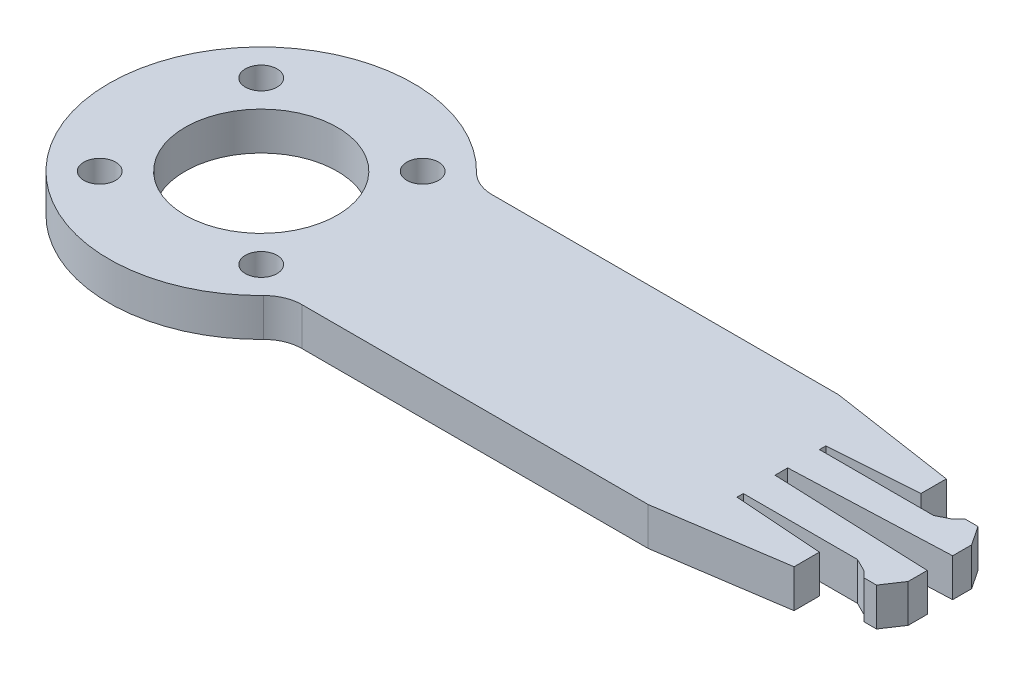
ISO-10303-21;
HEADER;
FILE_DESCRIPTION(('STEP AP214'),'2;1');
FILE_NAME('part.step','',(''),(''),'','','');
FILE_SCHEMA(('AUTOMOTIVE_DESIGN { 1 0 10303 214 1 1 1 1 }'));
ENDSEC;
DATA;
#1=APPLICATION_CONTEXT('core data for automotive mechanical design processes');
#2=APPLICATION_PROTOCOL_DEFINITION('international standard','automotive_design',2000,#1);
#3=PRODUCT_CONTEXT('',#1,'mechanical');
#4=PRODUCT('Part','Part','',(#3));
#5=PRODUCT_RELATED_PRODUCT_CATEGORY('part','',(#4));
#6=PRODUCT_DEFINITION_FORMATION('','',#4);
#7=PRODUCT_DEFINITION_CONTEXT('part definition',#1,'design');
#8=PRODUCT_DEFINITION('design','',#6,#7);
#9=PRODUCT_DEFINITION_SHAPE('','',#8);
#10=(LENGTH_UNIT() NAMED_UNIT(*) SI_UNIT(.MILLI.,.METRE.));
#11=(NAMED_UNIT(*) PLANE_ANGLE_UNIT() SI_UNIT($,.RADIAN.));
#12=(NAMED_UNIT(*) SI_UNIT($,.STERADIAN.) SOLID_ANGLE_UNIT());
#13=UNCERTAINTY_MEASURE_WITH_UNIT(LENGTH_MEASURE(1.E-05),#10,'distance_accuracy_value','');
#14=(GEOMETRIC_REPRESENTATION_CONTEXT(3) GLOBAL_UNCERTAINTY_ASSIGNED_CONTEXT((#13)) GLOBAL_UNIT_ASSIGNED_CONTEXT((#10,
#11,#12)) REPRESENTATION_CONTEXT('',''));
#15=CARTESIAN_POINT('',(0.,0.,0.));
#16=DIRECTION('',(0.,0.,1.));
#17=DIRECTION('',(1.,0.,0.));
#18=AXIS2_PLACEMENT_3D('',#15,#16,#17);
#19=CARTESIAN_POINT('',(1.93643031784841,1.5,12.9095354523227));
#20=DIRECTION('',(0.148340452930245,0.,0.988936352868298));
#21=DIRECTION('',(0.988936352868298,0.,-0.148340452930245));
#22=AXIS2_PLACEMENT_3D('',#19,#20,#21);
#23=PLANE('',#22);
#24=DIRECTION('',(-0.988936352868298,0.,0.148340452930245));
#25=VECTOR('',#24,1.);
#26=CARTESIAN_POINT('',(1.93643031784841,-1.5,12.9095354523227));
#27=LINE('',#26,#25);
#28=CARTESIAN_POINT('',(48.,-1.5,6.));
#29=VERTEX_POINT('',#28);
#30=CARTESIAN_POINT('',(38.,-1.5,7.5));
#31=VERTEX_POINT('',#30);
#32=EDGE_CURVE('E224',#29,#31,#27,.T.);
#33=ORIENTED_EDGE('',*,*,#32,.F.);
#34=DIRECTION('',(0.,-1.,0.));
#35=VECTOR('',#34,1.);
#36=CARTESIAN_POINT('',(48.,1.5,6.));
#37=LINE('',#36,#35);
#38=CARTESIAN_POINT('',(48.,1.5,6.));
#39=VERTEX_POINT('',#38);
#40=EDGE_CURVE('E219',#39,#29,#37,.T.);
#41=ORIENTED_EDGE('',*,*,#40,.F.);
#42=DIRECTION('',(-0.988936352868298,0.,0.148340452930245));
#43=VECTOR('',#42,1.);
#44=CARTESIAN_POINT('',(1.93643031784841,1.5,12.9095354523227));
#45=LINE('',#44,#43);
#46=CARTESIAN_POINT('',(38.,1.5,7.5));
#47=VERTEX_POINT('',#46);
#48=EDGE_CURVE('E222',#39,#47,#45,.T.);
#49=ORIENTED_EDGE('',*,*,#48,.T.);
#50=DIRECTION('',(0.,-1.,0.));
#51=VECTOR('',#50,1.);
#52=CARTESIAN_POINT('',(38.,1.5,7.5));
#53=LINE('',#52,#51);
#54=EDGE_CURVE('E320',#47,#31,#53,.T.);
#55=ORIENTED_EDGE('',*,*,#54,.T.);
#56=EDGE_LOOP('',(#33,#41,#49,#55));
#57=FACE_BOUND('',#56,.T.);
#58=ADVANCED_FACE('F36',(#57),#23,.T.);
#59=CARTESIAN_POINT('',(48.,1.5,0.));
#60=DIRECTION('',(1.,0.,0.));
#61=DIRECTION('',(0.,0.,-1.));
#62=AXIS2_PLACEMENT_3D('',#59,#60,#61);
#63=PLANE('',#62);
#64=DIRECTION('',(0.,0.,1.));
#65=VECTOR('',#64,1.);
#66=CARTESIAN_POINT('',(48.,-1.5,0.));
#67=LINE('',#66,#65);
#68=CARTESIAN_POINT('',(48.,-1.5,4.));
#69=VERTEX_POINT('',#68);
#70=EDGE_CURVE('E322',#69,#29,#67,.T.);
#71=ORIENTED_EDGE('',*,*,#70,.F.);
#72=DIRECTION('',(0.,-1.,0.));
#73=VECTOR('',#72,1.);
#74=CARTESIAN_POINT('',(48.,1.5,4.));
#75=LINE('',#74,#73);
#76=CARTESIAN_POINT('',(48.,1.5,4.));
#77=VERTEX_POINT('',#76);
#78=EDGE_CURVE('E230',#77,#69,#75,.T.);
#79=ORIENTED_EDGE('',*,*,#78,.F.);
#80=DIRECTION('',(0.,0.,1.));
#81=VECTOR('',#80,1.);
#82=CARTESIAN_POINT('',(48.,1.5,0.));
#83=LINE('',#82,#81);
#84=EDGE_CURVE('E237',#77,#39,#83,.T.);
#85=ORIENTED_EDGE('',*,*,#84,.T.);
#86=ORIENTED_EDGE('',*,*,#40,.T.);
#87=EDGE_LOOP('',(#71,#79,#85,#86));
#88=FACE_BOUND('',#87,.T.);
#89=ADVANCED_FACE('F244',(#88),#63,.T.);
#90=CARTESIAN_POINT('',(-0.0406091370558376,1.5,0.568527918781726));
#91=DIRECTION('',(0.0712470499879096,0.,-0.997458699830735));
#92=DIRECTION('',(-0.997458699830735,0.,-0.0712470499879096));
#93=AXIS2_PLACEMENT_3D('',#90,#91,#92);
#94=PLANE('',#93);
#95=DIRECTION('',(0.997458699830735,0.,0.0712470499879096));
#96=VECTOR('',#95,1.);
#97=CARTESIAN_POINT('',(-0.0406091370558376,-1.5,0.568527918781726));
#98=LINE('',#97,#96);
#99=CARTESIAN_POINT('',(41.,-1.5,3.5));
#100=VERTEX_POINT('',#99);
#101=EDGE_CURVE('E324',#100,#69,#98,.T.);
#102=ORIENTED_EDGE('',*,*,#101,.F.);
#103=DIRECTION('',(0.,-1.,0.));
#104=VECTOR('',#103,1.);
#105=CARTESIAN_POINT('',(41.,1.5,3.5));
#106=LINE('',#105,#104);
#107=CARTESIAN_POINT('',(41.,1.5,3.5));
#108=VERTEX_POINT('',#107);
#109=EDGE_CURVE('E450',#108,#100,#106,.T.);
#110=ORIENTED_EDGE('',*,*,#109,.F.);
#111=DIRECTION('',(0.997458699830735,0.,0.0712470499879096));
#112=VECTOR('',#111,1.);
#113=CARTESIAN_POINT('',(-0.0406091370558376,1.5,0.568527918781726));
#114=LINE('',#113,#112);
#115=EDGE_CURVE('E245',#108,#77,#114,.T.);
#116=ORIENTED_EDGE('',*,*,#115,.T.);
#117=ORIENTED_EDGE('',*,*,#78,.T.);
#118=EDGE_LOOP('',(#102,#110,#116,#117));
#119=FACE_BOUND('',#118,.T.);
#120=ADVANCED_FACE('F573',(#119),#94,.T.);
#121=CARTESIAN_POINT('',(41.,1.5,-5.68989300120392E-13));
#122=DIRECTION('',(1.,0.,0.));
#123=DIRECTION('',(0.,0.,-1.));
#124=AXIS2_PLACEMENT_3D('',#121,#122,#123);
#125=PLANE('',#124);
#126=DIRECTION('',(0.,0.,1.));
#127=VECTOR('',#126,1.);
#128=CARTESIAN_POINT('',(41.,-1.5,-5.68989300120392E-13));
#129=LINE('',#128,#127);
#130=CARTESIAN_POINT('',(41.,-1.5,3.));
#131=VERTEX_POINT('',#130);
#132=EDGE_CURVE('E327',#131,#100,#129,.T.);
#133=ORIENTED_EDGE('',*,*,#132,.F.);
#134=DIRECTION('',(0.,-1.,0.));
#135=VECTOR('',#134,1.);
#136=CARTESIAN_POINT('',(41.,1.5,3.));
#137=LINE('',#136,#135);
#138=CARTESIAN_POINT('',(41.,1.5,3.));
#139=VERTEX_POINT('',#138);
#140=EDGE_CURVE('E448',#139,#131,#137,.T.);
#141=ORIENTED_EDGE('',*,*,#140,.F.);
#142=DIRECTION('',(0.,0.,1.));
#143=VECTOR('',#142,1.);
#144=CARTESIAN_POINT('',(41.,1.5,-5.68989300120392E-13));
#145=LINE('',#144,#143);
#146=EDGE_CURVE('E247',#139,#108,#145,.T.);
#147=ORIENTED_EDGE('',*,*,#146,.T.);
#148=ORIENTED_EDGE('',*,*,#109,.T.);
#149=EDGE_LOOP('',(#133,#141,#147,#148));
#150=FACE_BOUND('',#149,.T.);
#151=ADVANCED_FACE('F570',(#150),#125,.T.);
#152=CARTESIAN_POINT('',(0.,1.5,2.99999999999999));
#153=DIRECTION('',(0.,0.,1.));
#154=DIRECTION('',(1.,0.,0.));
#155=AXIS2_PLACEMENT_3D('',#152,#153,#154);
#156=PLANE('',#155);
#157=DIRECTION('',(-1.,0.,0.));
#158=VECTOR('',#157,1.);
#159=CARTESIAN_POINT('',(0.,-1.5,2.99999999999999));
#160=LINE('',#159,#158);
#161=CARTESIAN_POINT('',(50.,-1.5,3.));
#162=VERTEX_POINT('',#161);
#163=EDGE_CURVE('E330',#162,#131,#160,.T.);
#164=ORIENTED_EDGE('',*,*,#163,.F.);
#165=DIRECTION('',(0.,-1.,0.));
#166=VECTOR('',#165,1.);
#167=CARTESIAN_POINT('',(50.,1.5,3.));
#168=LINE('',#167,#166);
#169=CARTESIAN_POINT('',(50.,1.5,3.));
#170=VERTEX_POINT('',#169);
#171=EDGE_CURVE('E446',#170,#162,#168,.T.);
#172=ORIENTED_EDGE('',*,*,#171,.F.);
#173=DIRECTION('',(-1.,0.,0.));
#174=VECTOR('',#173,1.);
#175=CARTESIAN_POINT('',(0.,1.5,2.99999999999999));
#176=LINE('',#175,#174);
#177=EDGE_CURVE('E252',#170,#139,#176,.T.);
#178=ORIENTED_EDGE('',*,*,#177,.T.);
#179=ORIENTED_EDGE('',*,*,#140,.T.);
#180=EDGE_LOOP('',(#164,#172,#178,#179));
#181=FACE_BOUND('',#180,.T.);
#182=ADVANCED_FACE('F566',(#181),#156,.T.);
#183=CARTESIAN_POINT('',(8.79999999999998,1.5,-17.6));
#184=DIRECTION('',(-0.447213595499958,0.,0.894427190999916));
#185=DIRECTION('',(0.894427190999916,0.,0.447213595499958));
#186=AXIS2_PLACEMENT_3D('',#183,#184,#185);
#187=PLANE('',#186);
#188=DIRECTION('',(-0.894427190999916,0.,-0.447213595499958));
#189=VECTOR('',#188,1.);
#190=CARTESIAN_POINT('',(8.79999999999998,-1.5,-17.6));
#191=LINE('',#190,#189);
#192=CARTESIAN_POINT('',(51.,-1.5,3.5));
#193=VERTEX_POINT('',#192);
#194=EDGE_CURVE('E333',#193,#162,#191,.T.);
#195=ORIENTED_EDGE('',*,*,#194,.F.);
#196=DIRECTION('',(0.,-1.,0.));
#197=VECTOR('',#196,1.);
#198=CARTESIAN_POINT('',(51.,1.5,3.5));
#199=LINE('',#198,#197);
#200=CARTESIAN_POINT('',(51.,1.5,3.5));
#201=VERTEX_POINT('',#200);
#202=EDGE_CURVE('E444',#201,#193,#199,.T.);
#203=ORIENTED_EDGE('',*,*,#202,.F.);
#204=DIRECTION('',(-0.894427190999916,0.,-0.447213595499958));
#205=VECTOR('',#204,1.);
#206=CARTESIAN_POINT('',(8.79999999999998,1.5,-17.6));
#207=LINE('',#206,#205);
#208=EDGE_CURVE('E255',#201,#170,#207,.T.);
#209=ORIENTED_EDGE('',*,*,#208,.T.);
#210=ORIENTED_EDGE('',*,*,#171,.T.);
#211=EDGE_LOOP('',(#195,#203,#209,#210));
#212=FACE_BOUND('',#211,.T.);
#213=ADVANCED_FACE('F562',(#212),#187,.T.);
#214=CARTESIAN_POINT('',(23.75,1.5,-23.75));
#215=DIRECTION('',(-0.707106781186547,0.,0.707106781186548));
#216=DIRECTION('',(0.707106781186548,0.,0.707106781186547));
#217=AXIS2_PLACEMENT_3D('',#214,#215,#216);
#218=PLANE('',#217);
#219=DIRECTION('',(-0.707106781186548,0.,-0.707106781186547));
#220=VECTOR('',#219,1.);
#221=CARTESIAN_POINT('',(23.75,-1.5,-23.75));
#222=LINE('',#221,#220);
#223=CARTESIAN_POINT('',(51.5,-1.5,4.));
#224=VERTEX_POINT('',#223);
#225=EDGE_CURVE('E336',#224,#193,#222,.T.);
#226=ORIENTED_EDGE('',*,*,#225,.F.);
#227=DIRECTION('',(0.,-1.,0.));
#228=VECTOR('',#227,1.);
#229=CARTESIAN_POINT('',(51.5,1.5,4.));
#230=LINE('',#229,#228);
#231=CARTESIAN_POINT('',(51.5,1.5,4.));
#232=VERTEX_POINT('',#231);
#233=EDGE_CURVE('E442',#232,#224,#230,.T.);
#234=ORIENTED_EDGE('',*,*,#233,.F.);
#235=DIRECTION('',(-0.707106781186548,0.,-0.707106781186547));
#236=VECTOR('',#235,1.);
#237=CARTESIAN_POINT('',(23.75,1.5,-23.75));
#238=LINE('',#237,#236);
#239=EDGE_CURVE('E258',#232,#201,#238,.T.);
#240=ORIENTED_EDGE('',*,*,#239,.T.);
#241=ORIENTED_EDGE('',*,*,#202,.T.);
#242=EDGE_LOOP('',(#226,#234,#240,#241));
#243=FACE_BOUND('',#242,.T.);
#244=ADVANCED_FACE('F558',(#243),#218,.T.);
#245=CARTESIAN_POINT('',(0.,1.5,3.99999999999996));
#246=DIRECTION('',(0.,0.,1.));
#247=DIRECTION('',(1.,0.,0.));
#248=AXIS2_PLACEMENT_3D('',#245,#246,#247);
#249=PLANE('',#248);
#250=DIRECTION('',(-1.,0.,0.));
#251=VECTOR('',#250,1.);
#252=CARTESIAN_POINT('',(0.,-1.5,3.99999999999996));
#253=LINE('',#252,#251);
#254=CARTESIAN_POINT('',(52.5,-1.5,4.));
#255=VERTEX_POINT('',#254);
#256=EDGE_CURVE('E339',#255,#224,#253,.T.);
#257=ORIENTED_EDGE('',*,*,#256,.F.);
#258=DIRECTION('',(0.,-1.,0.));
#259=VECTOR('',#258,1.);
#260=CARTESIAN_POINT('',(52.5,1.5,4.));
#261=LINE('',#260,#259);
#262=CARTESIAN_POINT('',(52.5,1.5,4.));
#263=VERTEX_POINT('',#262);
#264=EDGE_CURVE('E440',#263,#255,#261,.T.);
#265=ORIENTED_EDGE('',*,*,#264,.F.);
#266=DIRECTION('',(-1.,0.,0.));
#267=VECTOR('',#266,1.);
#268=CARTESIAN_POINT('',(0.,1.5,3.99999999999996));
#269=LINE('',#268,#267);
#270=EDGE_CURVE('E261',#263,#232,#269,.T.);
#271=ORIENTED_EDGE('',*,*,#270,.T.);
#272=ORIENTED_EDGE('',*,*,#233,.T.);
#273=EDGE_LOOP('',(#257,#265,#271,#272));
#274=FACE_BOUND('',#273,.T.);
#275=ADVANCED_FACE('F554',(#274),#249,.T.);
#276=CARTESIAN_POINT('',(38.1923076923077,1.5,25.4615384615385));
#277=DIRECTION('',(0.832050294337844,0.,0.554700196225229));
#278=DIRECTION('',(0.554700196225229,0.,-0.832050294337843));
#279=AXIS2_PLACEMENT_3D('',#276,#277,#278);
#280=PLANE('',#279);
#281=DIRECTION('',(-0.554700196225229,0.,0.832050294337844));
#282=VECTOR('',#281,1.);
#283=CARTESIAN_POINT('',(38.1923076923077,-1.5,25.4615384615385));
#284=LINE('',#283,#282);
#285=CARTESIAN_POINT('',(53.5,-1.5,2.5));
#286=VERTEX_POINT('',#285);
#287=EDGE_CURVE('E342',#286,#255,#284,.T.);
#288=ORIENTED_EDGE('',*,*,#287,.F.);
#289=DIRECTION('',(0.,-1.,0.));
#290=VECTOR('',#289,1.);
#291=CARTESIAN_POINT('',(53.5,1.5,2.5));
#292=LINE('',#291,#290);
#293=CARTESIAN_POINT('',(53.5,1.5,2.5));
#294=VERTEX_POINT('',#293);
#295=EDGE_CURVE('E438',#294,#286,#292,.T.);
#296=ORIENTED_EDGE('',*,*,#295,.F.);
#297=DIRECTION('',(-0.554700196225229,0.,0.832050294337844));
#298=VECTOR('',#297,1.);
#299=CARTESIAN_POINT('',(38.1923076923077,1.5,25.4615384615385));
#300=LINE('',#299,#298);
#301=EDGE_CURVE('E264',#294,#263,#300,.T.);
#302=ORIENTED_EDGE('',*,*,#301,.T.);
#303=ORIENTED_EDGE('',*,*,#264,.T.);
#304=EDGE_LOOP('',(#288,#296,#302,#303));
#305=FACE_BOUND('',#304,.T.);
#306=ADVANCED_FACE('F550',(#305),#280,.T.);
#307=CARTESIAN_POINT('',(53.5,1.5,0.));
#308=DIRECTION('',(1.,0.,0.));
#309=DIRECTION('',(0.,0.,-1.));
#310=AXIS2_PLACEMENT_3D('',#307,#308,#309);
#311=PLANE('',#310);
#312=DIRECTION('',(0.,0.,1.));
#313=VECTOR('',#312,1.);
#314=CARTESIAN_POINT('',(53.5,-1.5,0.));
#315=LINE('',#314,#313);
#316=CARTESIAN_POINT('',(53.5,-1.5,1.));
#317=VERTEX_POINT('',#316);
#318=EDGE_CURVE('E345',#317,#286,#315,.T.);
#319=ORIENTED_EDGE('',*,*,#318,.F.);
#320=DIRECTION('',(0.,-1.,0.));
#321=VECTOR('',#320,1.);
#322=CARTESIAN_POINT('',(53.5,1.5,1.));
#323=LINE('',#322,#321);
#324=CARTESIAN_POINT('',(53.5,1.5,1.));
#325=VERTEX_POINT('',#324);
#326=EDGE_CURVE('E436',#325,#317,#323,.T.);
#327=ORIENTED_EDGE('',*,*,#326,.F.);
#328=DIRECTION('',(0.,0.,1.));
#329=VECTOR('',#328,1.);
#330=CARTESIAN_POINT('',(53.5,1.5,0.));
#331=LINE('',#330,#329);
#332=EDGE_CURVE('E267',#325,#294,#331,.T.);
#333=ORIENTED_EDGE('',*,*,#332,.T.);
#334=ORIENTED_EDGE('',*,*,#295,.T.);
#335=EDGE_LOOP('',(#319,#327,#333,#334));
#336=FACE_BOUND('',#335,.T.);
#337=ADVANCED_FACE('F546',(#336),#311,.T.);
#338=CARTESIAN_POINT('',(0.0455271565495208,1.5,-1.13817891373802));
#339=DIRECTION('',(0.0399680383488716,0.,-0.999200958721789));
#340=DIRECTION('',(-0.99920095872179,0.,-0.0399680383488716));
#341=AXIS2_PLACEMENT_3D('',#338,#339,#340);
#342=PLANE('',#341);
#343=DIRECTION('',(0.99920095872179,0.,0.0399680383488716));
#344=VECTOR('',#343,1.);
#345=CARTESIAN_POINT('',(0.0455271565495208,-1.5,-1.13817891373802));
#346=LINE('',#345,#344);
#347=CARTESIAN_POINT('',(41.,-1.5,0.5));
#348=VERTEX_POINT('',#347);
#349=EDGE_CURVE('E348',#348,#317,#346,.T.);
#350=ORIENTED_EDGE('',*,*,#349,.F.);
#351=DIRECTION('',(0.,-1.,0.));
#352=VECTOR('',#351,1.);
#353=CARTESIAN_POINT('',(41.,1.5,0.5));
#354=LINE('',#353,#352);
#355=CARTESIAN_POINT('',(41.,1.5,0.5));
#356=VERTEX_POINT('',#355);
#357=EDGE_CURVE('E434',#356,#348,#354,.T.);
#358=ORIENTED_EDGE('',*,*,#357,.F.);
#359=DIRECTION('',(0.99920095872179,0.,0.0399680383488716));
#360=VECTOR('',#359,1.);
#361=CARTESIAN_POINT('',(0.0455271565495208,1.5,-1.13817891373802));
#362=LINE('',#361,#360);
#363=EDGE_CURVE('E270',#356,#325,#362,.T.);
#364=ORIENTED_EDGE('',*,*,#363,.T.);
#365=ORIENTED_EDGE('',*,*,#326,.T.);
#366=EDGE_LOOP('',(#350,#358,#364,#365));
#367=FACE_BOUND('',#366,.T.);
#368=ADVANCED_FACE('F542',(#367),#342,.T.);
#369=CARTESIAN_POINT('',(41.,1.5,0.));
#370=DIRECTION('',(1.,0.,0.));
#371=DIRECTION('',(0.,0.,-1.));
#372=AXIS2_PLACEMENT_3D('',#369,#370,#371);
#373=PLANE('',#372);
#374=DIRECTION('',(0.,0.,1.));
#375=VECTOR('',#374,1.);
#376=CARTESIAN_POINT('',(41.,-1.5,0.));
#377=LINE('',#376,#375);
#378=CARTESIAN_POINT('',(41.,-1.5,-0.5));
#379=VERTEX_POINT('',#378);
#380=EDGE_CURVE('E351',#379,#348,#377,.T.);
#381=ORIENTED_EDGE('',*,*,#380,.F.);
#382=DIRECTION('',(0.,-1.,0.));
#383=VECTOR('',#382,1.);
#384=CARTESIAN_POINT('',(41.,1.5,-0.5));
#385=LINE('',#384,#383);
#386=CARTESIAN_POINT('',(41.,1.5,-0.5));
#387=VERTEX_POINT('',#386);
#388=EDGE_CURVE('E432',#387,#379,#385,.T.);
#389=ORIENTED_EDGE('',*,*,#388,.F.);
#390=DIRECTION('',(0.,0.,1.));
#391=VECTOR('',#390,1.);
#392=CARTESIAN_POINT('',(41.,1.5,0.));
#393=LINE('',#392,#391);
#394=EDGE_CURVE('E273',#387,#356,#393,.T.);
#395=ORIENTED_EDGE('',*,*,#394,.T.);
#396=ORIENTED_EDGE('',*,*,#357,.T.);
#397=EDGE_LOOP('',(#381,#389,#395,#396));
#398=FACE_BOUND('',#397,.T.);
#399=ADVANCED_FACE('F536',(#398),#373,.T.);
#400=CARTESIAN_POINT('',(0.0455271565495208,1.5,1.13817891373802));
#401=DIRECTION('',(-0.0399680383488716,0.,-0.999200958721789));
#402=DIRECTION('',(-0.99920095872179,0.,0.0399680383488716));
#403=AXIS2_PLACEMENT_3D('',#400,#401,#402);
#404=PLANE('',#403);
#405=DIRECTION('',(0.99920095872179,0.,-0.0399680383488716));
#406=VECTOR('',#405,1.);
#407=CARTESIAN_POINT('',(0.0455271565495208,-1.5,1.13817891373802));
#408=LINE('',#407,#406);
#409=CARTESIAN_POINT('',(53.5,-1.5,-1.));
#410=VERTEX_POINT('',#409);
#411=EDGE_CURVE('E354',#379,#410,#408,.T.);
#412=ORIENTED_EDGE('',*,*,#411,.T.);
#413=DIRECTION('',(0.,-1.,0.));
#414=VECTOR('',#413,1.);
#415=CARTESIAN_POINT('',(53.5,1.5,-1.));
#416=LINE('',#415,#414);
#417=CARTESIAN_POINT('',(53.5,1.5,-1.));
#418=VERTEX_POINT('',#417);
#419=EDGE_CURVE('E429',#418,#410,#416,.T.);
#420=ORIENTED_EDGE('',*,*,#419,.F.);
#421=DIRECTION('',(0.99920095872179,0.,-0.0399680383488716));
#422=VECTOR('',#421,1.);
#423=CARTESIAN_POINT('',(0.0455271565495208,1.5,1.13817891373802));
#424=LINE('',#423,#422);
#425=EDGE_CURVE('E276',#387,#418,#424,.T.);
#426=ORIENTED_EDGE('',*,*,#425,.F.);
#427=ORIENTED_EDGE('',*,*,#388,.T.);
#428=EDGE_LOOP('',(#412,#420,#426,#427));
#429=FACE_BOUND('',#428,.T.);
#430=ADVANCED_FACE('F574',(#429),#404,.F.);
#431=CARTESIAN_POINT('',(53.5,1.5,0.));
#432=DIRECTION('',(-1.,0.,0.));
#433=DIRECTION('',(0.,0.,1.));
#434=AXIS2_PLACEMENT_3D('',#431,#432,#433);
#435=PLANE('',#434);
#436=DIRECTION('',(0.,0.,-1.));
#437=VECTOR('',#436,1.);
#438=CARTESIAN_POINT('',(53.5,-1.5,0.));
#439=LINE('',#438,#437);
#440=CARTESIAN_POINT('',(53.5,-1.5,-2.5));
#441=VERTEX_POINT('',#440);
#442=EDGE_CURVE('E356',#410,#441,#439,.T.);
#443=ORIENTED_EDGE('',*,*,#442,.T.);
#444=DIRECTION('',(0.,-1.,0.));
#445=VECTOR('',#444,1.);
#446=CARTESIAN_POINT('',(53.5,1.5,-2.5));
#447=LINE('',#446,#445);
#448=CARTESIAN_POINT('',(53.5,1.5,-2.5));
#449=VERTEX_POINT('',#448);
#450=EDGE_CURVE('E426',#449,#441,#447,.T.);
#451=ORIENTED_EDGE('',*,*,#450,.F.);
#452=DIRECTION('',(0.,0.,-1.));
#453=VECTOR('',#452,1.);
#454=CARTESIAN_POINT('',(53.5,1.5,0.));
#455=LINE('',#454,#453);
#456=EDGE_CURVE('E278',#418,#449,#455,.T.);
#457=ORIENTED_EDGE('',*,*,#456,.F.);
#458=ORIENTED_EDGE('',*,*,#419,.T.);
#459=EDGE_LOOP('',(#443,#451,#457,#458));
#460=FACE_BOUND('',#459,.T.);
#461=ADVANCED_FACE('F530',(#460),#435,.F.);
#462=CARTESIAN_POINT('',(38.1923076923077,1.5,-25.4615384615385));
#463=DIRECTION('',(-0.832050294337844,0.,0.554700196225229));
#464=DIRECTION('',(0.554700196225229,0.,0.832050294337843));
#465=AXIS2_PLACEMENT_3D('',#462,#463,#464);
#466=PLANE('',#465);
#467=DIRECTION('',(-0.554700196225229,0.,-0.832050294337844));
#468=VECTOR('',#467,1.);
#469=CARTESIAN_POINT('',(38.1923076923077,-1.5,-25.4615384615385));
#470=LINE('',#469,#468);
#471=CARTESIAN_POINT('',(52.5,-1.5,-4.));
#472=VERTEX_POINT('',#471);
#473=EDGE_CURVE('E358',#441,#472,#470,.T.);
#474=ORIENTED_EDGE('',*,*,#473,.T.);
#475=DIRECTION('',(0.,-1.,0.));
#476=VECTOR('',#475,1.);
#477=CARTESIAN_POINT('',(52.5,1.5,-4.));
#478=LINE('',#477,#476);
#479=CARTESIAN_POINT('',(52.5,1.5,-4.));
#480=VERTEX_POINT('',#479);
#481=EDGE_CURVE('E423',#480,#472,#478,.T.);
#482=ORIENTED_EDGE('',*,*,#481,.F.);
#483=DIRECTION('',(-0.554700196225229,0.,-0.832050294337844));
#484=VECTOR('',#483,1.);
#485=CARTESIAN_POINT('',(38.1923076923077,1.5,-25.4615384615385));
#486=LINE('',#485,#484);
#487=EDGE_CURVE('E280',#449,#480,#486,.T.);
#488=ORIENTED_EDGE('',*,*,#487,.F.);
#489=ORIENTED_EDGE('',*,*,#450,.T.);
#490=EDGE_LOOP('',(#474,#482,#488,#489));
#491=FACE_BOUND('',#490,.T.);
#492=ADVANCED_FACE('F526',(#491),#466,.F.);
#493=CARTESIAN_POINT('',(0.,1.5,-3.99999999999996));
#494=DIRECTION('',(0.,0.,1.));
#495=DIRECTION('',(1.,0.,0.));
#496=AXIS2_PLACEMENT_3D('',#493,#494,#495);
#497=PLANE('',#496);
#498=DIRECTION('',(-1.,0.,0.));
#499=VECTOR('',#498,1.);
#500=CARTESIAN_POINT('',(0.,-1.5,-3.99999999999996));
#501=LINE('',#500,#499);
#502=CARTESIAN_POINT('',(51.5,-1.5,-4.));
#503=VERTEX_POINT('',#502);
#504=EDGE_CURVE('E360',#472,#503,#501,.T.);
#505=ORIENTED_EDGE('',*,*,#504,.T.);
#506=DIRECTION('',(0.,-1.,0.));
#507=VECTOR('',#506,1.);
#508=CARTESIAN_POINT('',(51.5,1.5,-4.));
#509=LINE('',#508,#507);
#510=CARTESIAN_POINT('',(51.5,1.5,-4.));
#511=VERTEX_POINT('',#510);
#512=EDGE_CURVE('E420',#511,#503,#509,.T.);
#513=ORIENTED_EDGE('',*,*,#512,.F.);
#514=DIRECTION('',(-1.,0.,0.));
#515=VECTOR('',#514,1.);
#516=CARTESIAN_POINT('',(0.,1.5,-3.99999999999996));
#517=LINE('',#516,#515);
#518=EDGE_CURVE('E282',#480,#511,#517,.T.);
#519=ORIENTED_EDGE('',*,*,#518,.F.);
#520=ORIENTED_EDGE('',*,*,#481,.T.);
#521=EDGE_LOOP('',(#505,#513,#519,#520));
#522=FACE_BOUND('',#521,.T.);
#523=ADVANCED_FACE('F521',(#522),#497,.F.);
#524=CARTESIAN_POINT('',(23.75,1.5,23.75));
#525=DIRECTION('',(0.707106781186547,0.,0.707106781186548));
#526=DIRECTION('',(0.707106781186548,0.,-0.707106781186547));
#527=AXIS2_PLACEMENT_3D('',#524,#525,#526);
#528=PLANE('',#527);
#529=DIRECTION('',(-0.707106781186548,0.,0.707106781186547));
#530=VECTOR('',#529,1.);
#531=CARTESIAN_POINT('',(23.75,-1.5,23.75));
#532=LINE('',#531,#530);
#533=CARTESIAN_POINT('',(51.,-1.5,-3.5));
#534=VERTEX_POINT('',#533);
#535=EDGE_CURVE('E362',#503,#534,#532,.T.);
#536=ORIENTED_EDGE('',*,*,#535,.T.);
#537=DIRECTION('',(0.,-1.,0.));
#538=VECTOR('',#537,1.);
#539=CARTESIAN_POINT('',(51.,1.5,-3.5));
#540=LINE('',#539,#538);
#541=CARTESIAN_POINT('',(51.,1.5,-3.5));
#542=VERTEX_POINT('',#541);
#543=EDGE_CURVE('E417',#542,#534,#540,.T.);
#544=ORIENTED_EDGE('',*,*,#543,.F.);
#545=DIRECTION('',(-0.707106781186548,0.,0.707106781186547));
#546=VECTOR('',#545,1.);
#547=CARTESIAN_POINT('',(23.75,1.5,23.75));
#548=LINE('',#547,#546);
#549=EDGE_CURVE('E284',#511,#542,#548,.T.);
#550=ORIENTED_EDGE('',*,*,#549,.F.);
#551=ORIENTED_EDGE('',*,*,#512,.T.);
#552=EDGE_LOOP('',(#536,#544,#550,#551));
#553=FACE_BOUND('',#552,.T.);
#554=ADVANCED_FACE('F515',(#553),#528,.F.);
#555=CARTESIAN_POINT('',(8.79999999999998,1.5,17.6));
#556=DIRECTION('',(0.447213595499958,0.,0.894427190999916));
#557=DIRECTION('',(0.894427190999916,0.,-0.447213595499958));
#558=AXIS2_PLACEMENT_3D('',#555,#556,#557);
#559=PLANE('',#558);
#560=DIRECTION('',(-0.894427190999916,0.,0.447213595499958));
#561=VECTOR('',#560,1.);
#562=CARTESIAN_POINT('',(8.79999999999998,-1.5,17.6));
#563=LINE('',#562,#561);
#564=CARTESIAN_POINT('',(50.,-1.5,-3.));
#565=VERTEX_POINT('',#564);
#566=EDGE_CURVE('E364',#534,#565,#563,.T.);
#567=ORIENTED_EDGE('',*,*,#566,.T.);
#568=DIRECTION('',(0.,-1.,0.));
#569=VECTOR('',#568,1.);
#570=CARTESIAN_POINT('',(50.,1.5,-3.));
#571=LINE('',#570,#569);
#572=CARTESIAN_POINT('',(50.,1.5,-3.));
#573=VERTEX_POINT('',#572);
#574=EDGE_CURVE('E414',#573,#565,#571,.T.);
#575=ORIENTED_EDGE('',*,*,#574,.F.);
#576=DIRECTION('',(-0.894427190999916,0.,0.447213595499958));
#577=VECTOR('',#576,1.);
#578=CARTESIAN_POINT('',(8.79999999999998,1.5,17.6));
#579=LINE('',#578,#577);
#580=EDGE_CURVE('E286',#542,#573,#579,.T.);
#581=ORIENTED_EDGE('',*,*,#580,.F.);
#582=ORIENTED_EDGE('',*,*,#543,.T.);
#583=EDGE_LOOP('',(#567,#575,#581,#582));
#584=FACE_BOUND('',#583,.T.);
#585=ADVANCED_FACE('F511',(#584),#559,.F.);
#586=CARTESIAN_POINT('',(0.,1.5,-2.99999999999999));
#587=DIRECTION('',(0.,0.,1.));
#588=DIRECTION('',(1.,0.,0.));
#589=AXIS2_PLACEMENT_3D('',#586,#587,#588);
#590=PLANE('',#589);
#591=DIRECTION('',(-1.,0.,0.));
#592=VECTOR('',#591,1.);
#593=CARTESIAN_POINT('',(0.,-1.5,-2.99999999999999));
#594=LINE('',#593,#592);
#595=CARTESIAN_POINT('',(41.,-1.5,-3.));
#596=VERTEX_POINT('',#595);
#597=EDGE_CURVE('E366',#565,#596,#594,.T.);
#598=ORIENTED_EDGE('',*,*,#597,.T.);
#599=DIRECTION('',(0.,-1.,0.));
#600=VECTOR('',#599,1.);
#601=CARTESIAN_POINT('',(41.,1.5,-3.));
#602=LINE('',#601,#600);
#603=CARTESIAN_POINT('',(41.,1.5,-3.));
#604=VERTEX_POINT('',#603);
#605=EDGE_CURVE('E411',#604,#596,#602,.T.);
#606=ORIENTED_EDGE('',*,*,#605,.F.);
#607=DIRECTION('',(-1.,0.,0.));
#608=VECTOR('',#607,1.);
#609=CARTESIAN_POINT('',(0.,1.5,-2.99999999999999));
#610=LINE('',#609,#608);
#611=EDGE_CURVE('E288',#573,#604,#610,.T.);
#612=ORIENTED_EDGE('',*,*,#611,.F.);
#613=ORIENTED_EDGE('',*,*,#574,.T.);
#614=EDGE_LOOP('',(#598,#606,#612,#613));
#615=FACE_BOUND('',#614,.T.);
#616=ADVANCED_FACE('F506',(#615),#590,.F.);
#617=CARTESIAN_POINT('',(41.,1.5,5.68989300120392E-13));
#618=DIRECTION('',(-1.,0.,0.));
#619=DIRECTION('',(0.,0.,1.));
#620=AXIS2_PLACEMENT_3D('',#617,#618,#619);
#621=PLANE('',#620);
#622=DIRECTION('',(0.,0.,-1.));
#623=VECTOR('',#622,1.);
#624=CARTESIAN_POINT('',(41.,-1.5,5.68989300120392E-13));
#625=LINE('',#624,#623);
#626=CARTESIAN_POINT('',(41.,-1.5,-3.5));
#627=VERTEX_POINT('',#626);
#628=EDGE_CURVE('E368',#596,#627,#625,.T.);
#629=ORIENTED_EDGE('',*,*,#628,.T.);
#630=DIRECTION('',(0.,-1.,0.));
#631=VECTOR('',#630,1.);
#632=CARTESIAN_POINT('',(41.,1.5,-3.5));
#633=LINE('',#632,#631);
#634=CARTESIAN_POINT('',(41.,1.5,-3.5));
#635=VERTEX_POINT('',#634);
#636=EDGE_CURVE('E408',#635,#627,#633,.T.);
#637=ORIENTED_EDGE('',*,*,#636,.F.);
#638=DIRECTION('',(0.,0.,-1.));
#639=VECTOR('',#638,1.);
#640=CARTESIAN_POINT('',(41.,1.5,5.68989300120392E-13));
#641=LINE('',#640,#639);
#642=EDGE_CURVE('E290',#604,#635,#641,.T.);
#643=ORIENTED_EDGE('',*,*,#642,.F.);
#644=ORIENTED_EDGE('',*,*,#605,.T.);
#645=EDGE_LOOP('',(#629,#637,#643,#644));
#646=FACE_BOUND('',#645,.T.);
#647=ADVANCED_FACE('F500',(#646),#621,.F.);
#648=CARTESIAN_POINT('',(-0.0406091370558376,1.5,-0.568527918781726));
#649=DIRECTION('',(-0.0712470499879096,0.,-0.997458699830735));
#650=DIRECTION('',(-0.997458699830735,0.,0.0712470499879096));
#651=AXIS2_PLACEMENT_3D('',#648,#649,#650);
#652=PLANE('',#651);
#653=DIRECTION('',(0.997458699830735,0.,-0.0712470499879096));
#654=VECTOR('',#653,1.);
#655=CARTESIAN_POINT('',(-0.0406091370558376,-1.5,-0.568527918781726));
#656=LINE('',#655,#654);
#657=CARTESIAN_POINT('',(48.,-1.5,-4.));
#658=VERTEX_POINT('',#657);
#659=EDGE_CURVE('E370',#627,#658,#656,.T.);
#660=ORIENTED_EDGE('',*,*,#659,.T.);
#661=DIRECTION('',(0.,-1.,0.));
#662=VECTOR('',#661,1.);
#663=CARTESIAN_POINT('',(48.,1.5,-4.));
#664=LINE('',#663,#662);
#665=CARTESIAN_POINT('',(48.,1.5,-4.));
#666=VERTEX_POINT('',#665);
#667=EDGE_CURVE('E405',#666,#658,#664,.T.);
#668=ORIENTED_EDGE('',*,*,#667,.F.);
#669=DIRECTION('',(0.997458699830735,0.,-0.0712470499879096));
#670=VECTOR('',#669,1.);
#671=CARTESIAN_POINT('',(-0.0406091370558376,1.5,-0.568527918781726));
#672=LINE('',#671,#670);
#673=EDGE_CURVE('E292',#635,#666,#672,.T.);
#674=ORIENTED_EDGE('',*,*,#673,.F.);
#675=ORIENTED_EDGE('',*,*,#636,.T.);
#676=EDGE_LOOP('',(#660,#668,#674,#675));
#677=FACE_BOUND('',#676,.T.);
#678=ADVANCED_FACE('F496',(#677),#652,.F.);
#679=CARTESIAN_POINT('',(48.,1.5,0.));
#680=DIRECTION('',(-1.,0.,0.));
#681=DIRECTION('',(0.,0.,1.));
#682=AXIS2_PLACEMENT_3D('',#679,#680,#681);
#683=PLANE('',#682);
#684=DIRECTION('',(0.,0.,-1.));
#685=VECTOR('',#684,1.);
#686=CARTESIAN_POINT('',(48.,-1.5,0.));
#687=LINE('',#686,#685);
#688=CARTESIAN_POINT('',(48.,-1.5,-6.));
#689=VERTEX_POINT('',#688);
#690=EDGE_CURVE('E372',#658,#689,#687,.T.);
#691=ORIENTED_EDGE('',*,*,#690,.T.);
#692=DIRECTION('',(0.,-1.,0.));
#693=VECTOR('',#692,1.);
#694=CARTESIAN_POINT('',(48.,1.5,-6.));
#695=LINE('',#694,#693);
#696=CARTESIAN_POINT('',(48.,1.5,-6.));
#697=VERTEX_POINT('',#696);
#698=EDGE_CURVE('E402',#697,#689,#695,.T.);
#699=ORIENTED_EDGE('',*,*,#698,.F.);
#700=DIRECTION('',(0.,0.,-1.));
#701=VECTOR('',#700,1.);
#702=CARTESIAN_POINT('',(48.,1.5,0.));
#703=LINE('',#702,#701);
#704=EDGE_CURVE('E294',#666,#697,#703,.T.);
#705=ORIENTED_EDGE('',*,*,#704,.F.);
#706=ORIENTED_EDGE('',*,*,#667,.T.);
#707=EDGE_LOOP('',(#691,#699,#705,#706));
#708=FACE_BOUND('',#707,.T.);
#709=ADVANCED_FACE('F491',(#708),#683,.F.);
#710=CARTESIAN_POINT('',(1.93643031784841,1.5,-12.9095354523227));
#711=DIRECTION('',(-0.148340452930245,0.,0.988936352868298));
#712=DIRECTION('',(0.988936352868298,0.,0.148340452930245));
#713=AXIS2_PLACEMENT_3D('',#710,#711,#712);
#714=PLANE('',#713);
#715=DIRECTION('',(-0.988936352868298,0.,-0.148340452930245));
#716=VECTOR('',#715,1.);
#717=CARTESIAN_POINT('',(1.93643031784841,-1.5,-12.9095354523227));
#718=LINE('',#717,#716);
#719=CARTESIAN_POINT('',(38.,-1.5,-7.5));
#720=VERTEX_POINT('',#719);
#721=EDGE_CURVE('E374',#689,#720,#718,.T.);
#722=ORIENTED_EDGE('',*,*,#721,.T.);
#723=DIRECTION('',(0.,-1.,0.));
#724=VECTOR('',#723,1.);
#725=CARTESIAN_POINT('',(38.,1.5,-7.5));
#726=LINE('',#725,#724);
#727=CARTESIAN_POINT('',(38.,1.5,-7.5));
#728=VERTEX_POINT('',#727);
#729=EDGE_CURVE('E399',#728,#720,#726,.T.);
#730=ORIENTED_EDGE('',*,*,#729,.F.);
#731=DIRECTION('',(-0.988936352868298,0.,-0.148340452930245));
#732=VECTOR('',#731,1.);
#733=CARTESIAN_POINT('',(1.93643031784841,1.5,-12.9095354523227));
#734=LINE('',#733,#732);
#735=EDGE_CURVE('E296',#697,#728,#734,.T.);
#736=ORIENTED_EDGE('',*,*,#735,.F.);
#737=ORIENTED_EDGE('',*,*,#698,.T.);
#738=EDGE_LOOP('',(#722,#730,#736,#737));
#739=FACE_BOUND('',#738,.T.);
#740=ADVANCED_FACE('F485',(#739),#714,.F.);
#741=CARTESIAN_POINT('',(0.,1.5,-7.5));
#742=DIRECTION('',(0.,0.,-1.));
#743=DIRECTION('',(-1.,0.,0.));
#744=AXIS2_PLACEMENT_3D('',#741,#742,#743);
#745=PLANE('',#744);
#746=DIRECTION('',(1.,0.,0.));
#747=VECTOR('',#746,1.);
#748=CARTESIAN_POINT('',(0.,-1.5,-7.5));
#749=LINE('',#748,#747);
#750=CARTESIAN_POINT('',(10.7121426428143,-1.5,-7.5));
#751=VERTEX_POINT('',#750);
#752=EDGE_CURVE('E377',#751,#720,#749,.T.);
#753=ORIENTED_EDGE('',*,*,#752,.F.);
#754=DIRECTION('',(0.,-1.,0.));
#755=VECTOR('',#754,1.);
#756=CARTESIAN_POINT('',(10.7121426428143,1.5,-7.5));
#757=LINE('',#756,#755);
#758=CARTESIAN_POINT('',(10.7121426428143,1.5,-7.5));
#759=VERTEX_POINT('',#758);
#760=EDGE_CURVE('E51',#751,#759,#757,.F.);
#761=ORIENTED_EDGE('',*,*,#760,.T.);
#762=DIRECTION('',(1.,0.,0.));
#763=VECTOR('',#762,1.);
#764=CARTESIAN_POINT('',(0.,1.5,-7.5));
#765=LINE('',#764,#763);
#766=EDGE_CURVE('E299',#759,#728,#765,.T.);
#767=ORIENTED_EDGE('',*,*,#766,.T.);
#768=ORIENTED_EDGE('',*,*,#729,.T.);
#769=EDGE_LOOP('',(#753,#761,#767,#768));
#770=FACE_BOUND('',#769,.T.);
#771=ADVANCED_FACE('F482',(#770),#745,.T.);
#772=CARTESIAN_POINT('',(0.,1.5,0.));
#773=DIRECTION('',(0.,-1.,0.));
#774=DIRECTION('',(0.,0.,-1.));
#775=AXIS2_PLACEMENT_3D('',#772,#773,#774);
#776=CYLINDRICAL_SURFACE('',#775,12.);
#777=CARTESIAN_POINT('',(0.,-1.5,0.));
#778=DIRECTION('',(0.,1.,0.));
#779=DIRECTION('',(0.,0.,1.));
#780=AXIS2_PLACEMENT_3D('',#777,#778,#779);
#781=CIRCLE('',#780,12.);
#782=CARTESIAN_POINT('',(8.56971411425142,-1.5,-8.4));
#783=VERTEX_POINT('',#782);
#784=CARTESIAN_POINT('',(8.56971411425142,-1.5,8.4));
#785=VERTEX_POINT('',#784);
#786=EDGE_CURVE('E379',#783,#785,#781,.T.);
#787=ORIENTED_EDGE('',*,*,#786,.T.);
#788=DIRECTION('',(0.,-1.,0.));
#789=VECTOR('',#788,1.);
#790=CARTESIAN_POINT('',(8.56971411425142,1.5,8.4));
#791=LINE('',#790,#789);
#792=CARTESIAN_POINT('',(8.56971411425142,1.5,8.4));
#793=VERTEX_POINT('',#792);
#794=EDGE_CURVE('E458',#785,#793,#791,.F.);
#795=ORIENTED_EDGE('',*,*,#794,.T.);
#796=CARTESIAN_POINT('',(0.,1.5,0.));
#797=DIRECTION('',(0.,1.,0.));
#798=DIRECTION('',(0.,0.,1.));
#799=AXIS2_PLACEMENT_3D('',#796,#797,#798);
#800=CIRCLE('',#799,12.);
#801=CARTESIAN_POINT('',(8.56971411425142,1.5,-8.4));
#802=VERTEX_POINT('',#801);
#803=EDGE_CURVE('E301',#802,#793,#800,.T.);
#804=ORIENTED_EDGE('',*,*,#803,.F.);
#805=DIRECTION('',(0.,-1.,0.));
#806=VECTOR('',#805,1.);
#807=CARTESIAN_POINT('',(8.56971411425142,1.5,-8.4));
#808=LINE('',#807,#806);
#809=EDGE_CURVE('E455',#802,#783,#808,.T.);
#810=ORIENTED_EDGE('',*,*,#809,.T.);
#811=EDGE_LOOP('',(#787,#795,#804,#810));
#812=FACE_BOUND('',#811,.T.);
#813=ADVANCED_FACE('F476',(#812),#776,.T.);
#814=CARTESIAN_POINT('',(6.36396103067891,1.5,-6.36396103067894));
#815=DIRECTION('',(0.,-1.,0.));
#816=DIRECTION('',(0.,0.,-1.));
#817=AXIS2_PLACEMENT_3D('',#814,#815,#816);
#818=CYLINDRICAL_SURFACE('',#817,1.25);
#819=CARTESIAN_POINT('',(6.36396103067891,1.5,-6.36396103067894));
#820=DIRECTION('',(0.,1.,0.));
#821=DIRECTION('',(0.,0.,1.));
#822=AXIS2_PLACEMENT_3D('',#819,#820,#821);
#823=CIRCLE('',#822,1.25);
#824=CARTESIAN_POINT('',(6.36396103067891,1.5,-5.11396103067894));
#825=VERTEX_POINT('',#824);
#826=EDGE_CURVE('E314',#825,#825,#823,.T.);
#827=ORIENTED_EDGE('',*,*,#826,.T.);
#828=EDGE_LOOP('',(#827));
#829=FACE_BOUND('',#828,.T.);
#830=CARTESIAN_POINT('',(6.36396103067891,-1.5,-6.36396103067894));
#831=DIRECTION('',(0.,1.,0.));
#832=DIRECTION('',(0.,0.,1.));
#833=AXIS2_PLACEMENT_3D('',#830,#831,#832);
#834=CIRCLE('',#833,1.25);
#835=CARTESIAN_POINT('',(6.36396103067891,-1.5,-5.11396103067894));
#836=VERTEX_POINT('',#835);
#837=EDGE_CURVE('E393',#836,#836,#834,.T.);
#838=ORIENTED_EDGE('',*,*,#837,.F.);
#839=EDGE_LOOP('',(#838));
#840=FACE_BOUND('',#839,.T.);
#841=ADVANCED_FACE('F605',(#829,#840),#818,.F.);
#842=CARTESIAN_POINT('',(-6.36396103067894,1.5,-6.36396103067892));
#843=DIRECTION('',(0.,-1.,0.));
#844=DIRECTION('',(0.,0.,-1.));
#845=AXIS2_PLACEMENT_3D('',#842,#843,#844);
#846=CYLINDRICAL_SURFACE('',#845,1.25);
#847=CARTESIAN_POINT('',(-6.36396103067894,1.5,-6.36396103067892));
#848=DIRECTION('',(0.,1.,0.));
#849=DIRECTION('',(0.,0.,1.));
#850=AXIS2_PLACEMENT_3D('',#847,#848,#849);
#851=CIRCLE('',#850,1.25);
#852=CARTESIAN_POINT('',(-6.36396103067894,1.5,-5.11396103067892));
#853=VERTEX_POINT('',#852);
#854=EDGE_CURVE('E311',#853,#853,#851,.T.);
#855=ORIENTED_EDGE('',*,*,#854,.T.);
#856=EDGE_LOOP('',(#855));
#857=FACE_BOUND('',#856,.T.);
#858=CARTESIAN_POINT('',(-6.36396103067894,-1.5,-6.36396103067892));
#859=DIRECTION('',(0.,1.,0.));
#860=DIRECTION('',(0.,0.,1.));
#861=AXIS2_PLACEMENT_3D('',#858,#859,#860);
#862=CIRCLE('',#861,1.25);
#863=CARTESIAN_POINT('',(-6.36396103067894,-1.5,-5.11396103067892));
#864=VERTEX_POINT('',#863);
#865=EDGE_CURVE('E390',#864,#864,#862,.T.);
#866=ORIENTED_EDGE('',*,*,#865,.F.);
#867=EDGE_LOOP('',(#866));
#868=FACE_BOUND('',#867,.T.);
#869=ADVANCED_FACE('F608',(#857,#868),#846,.F.);
#870=CARTESIAN_POINT('',(-6.36396103067891,1.5,6.36396103067894));
#871=DIRECTION('',(0.,-1.,0.));
#872=DIRECTION('',(0.,0.,-1.));
#873=AXIS2_PLACEMENT_3D('',#870,#871,#872);
#874=CYLINDRICAL_SURFACE('',#873,1.25);
#875=CARTESIAN_POINT('',(-6.36396103067891,1.5,6.36396103067894));
#876=DIRECTION('',(0.,1.,0.));
#877=DIRECTION('',(0.,0.,1.));
#878=AXIS2_PLACEMENT_3D('',#875,#876,#877);
#879=CIRCLE('',#878,1.25);
#880=CARTESIAN_POINT('',(-6.36396103067891,1.5,7.61396103067894));
#881=VERTEX_POINT('',#880);
#882=EDGE_CURVE('E308',#881,#881,#879,.T.);
#883=ORIENTED_EDGE('',*,*,#882,.T.);
#884=EDGE_LOOP('',(#883));
#885=FACE_BOUND('',#884,.T.);
#886=CARTESIAN_POINT('',(-6.36396103067891,-1.5,6.36396103067894));
#887=DIRECTION('',(0.,1.,0.));
#888=DIRECTION('',(0.,0.,1.));
#889=AXIS2_PLACEMENT_3D('',#886,#887,#888);
#890=CIRCLE('',#889,1.25);
#891=CARTESIAN_POINT('',(-6.36396103067891,-1.5,7.61396103067894));
#892=VERTEX_POINT('',#891);
#893=EDGE_CURVE('E387',#892,#892,#890,.T.);
#894=ORIENTED_EDGE('',*,*,#893,.F.);
#895=EDGE_LOOP('',(#894));
#896=FACE_BOUND('',#895,.T.);
#897=ADVANCED_FACE('F612',(#885,#896),#874,.F.);
#898=CARTESIAN_POINT('',(6.36396103067894,1.5,6.36396103067891));
#899=DIRECTION('',(0.,-1.,0.));
#900=DIRECTION('',(0.,0.,-1.));
#901=AXIS2_PLACEMENT_3D('',#898,#899,#900);
#902=CYLINDRICAL_SURFACE('',#901,1.25);
#903=CARTESIAN_POINT('',(6.36396103067894,1.5,6.36396103067891));
#904=DIRECTION('',(0.,1.,0.));
#905=DIRECTION('',(0.,0.,1.));
#906=AXIS2_PLACEMENT_3D('',#903,#904,#905);
#907=CIRCLE('',#906,1.25);
#908=CARTESIAN_POINT('',(6.36396103067894,1.5,7.61396103067892));
#909=VERTEX_POINT('',#908);
#910=EDGE_CURVE('E305',#909,#909,#907,.T.);
#911=ORIENTED_EDGE('',*,*,#910,.T.);
#912=EDGE_LOOP('',(#911));
#913=FACE_BOUND('',#912,.T.);
#914=CARTESIAN_POINT('',(6.36396103067894,-1.5,6.36396103067891));
#915=DIRECTION('',(0.,1.,0.));
#916=DIRECTION('',(0.,0.,1.));
#917=AXIS2_PLACEMENT_3D('',#914,#915,#916);
#918=CIRCLE('',#917,1.25);
#919=CARTESIAN_POINT('',(6.36396103067894,-1.5,7.61396103067892));
#920=VERTEX_POINT('',#919);
#921=EDGE_CURVE('E384',#920,#920,#918,.T.);
#922=ORIENTED_EDGE('',*,*,#921,.F.);
#923=EDGE_LOOP('',(#922));
#924=FACE_BOUND('',#923,.T.);
#925=ADVANCED_FACE('F616',(#913,#924),#902,.F.);
#926=CARTESIAN_POINT('',(0.,1.5,7.5));
#927=DIRECTION('',(0.,0.,-1.));
#928=DIRECTION('',(-1.,0.,0.));
#929=AXIS2_PLACEMENT_3D('',#926,#927,#928);
#930=PLANE('',#929);
#931=DIRECTION('',(1.,0.,0.));
#932=VECTOR('',#931,1.);
#933=CARTESIAN_POINT('',(0.,1.5,7.5));
#934=LINE('',#933,#932);
#935=CARTESIAN_POINT('',(10.7121426428143,1.5,7.5));
#936=VERTEX_POINT('',#935);
#937=EDGE_CURVE('E240',#936,#47,#934,.T.);
#938=ORIENTED_EDGE('',*,*,#937,.F.);
#939=DIRECTION('',(0.,1.,0.));
#940=VECTOR('',#939,1.);
#941=CARTESIAN_POINT('',(10.7121426428143,-1.5,7.5));
#942=LINE('',#941,#940);
#943=CARTESIAN_POINT('',(10.7121426428143,-1.5,7.5));
#944=VERTEX_POINT('',#943);
#945=EDGE_CURVE('E229',#936,#944,#942,.F.);
#946=ORIENTED_EDGE('',*,*,#945,.T.);
#947=DIRECTION('',(1.,0.,0.));
#948=VECTOR('',#947,1.);
#949=CARTESIAN_POINT('',(0.,-1.5,7.5));
#950=LINE('',#949,#948);
#951=EDGE_CURVE('E382',#944,#31,#950,.T.);
#952=ORIENTED_EDGE('',*,*,#951,.T.);
#953=ORIENTED_EDGE('',*,*,#54,.F.);
#954=EDGE_LOOP('',(#938,#946,#952,#953));
#955=FACE_BOUND('',#954,.T.);
#956=ADVANCED_FACE('F470',(#955),#930,.F.);
#957=CARTESIAN_POINT('',(0.,1.5,0.));
#958=DIRECTION('',(0.,-1.,0.));
#959=DIRECTION('',(0.,0.,-1.));
#960=AXIS2_PLACEMENT_3D('',#957,#958,#959);
#961=CYLINDRICAL_SURFACE('',#960,6.);
#962=CARTESIAN_POINT('',(0.,1.5,0.));
#963=DIRECTION('',(0.,1.,0.));
#964=DIRECTION('',(0.,0.,1.));
#965=AXIS2_PLACEMENT_3D('',#962,#963,#964);
#966=CIRCLE('',#965,6.);
#967=CARTESIAN_POINT('',(0.,1.5,6.));
#968=VERTEX_POINT('',#967);
#969=EDGE_CURVE('E317',#968,#968,#966,.T.);
#970=ORIENTED_EDGE('',*,*,#969,.T.);
#971=EDGE_LOOP('',(#970));
#972=FACE_BOUND('',#971,.T.);
#973=CARTESIAN_POINT('',(0.,-1.5,0.));
#974=DIRECTION('',(0.,1.,0.));
#975=DIRECTION('',(0.,0.,1.));
#976=AXIS2_PLACEMENT_3D('',#973,#974,#975);
#977=CIRCLE('',#976,6.);
#978=CARTESIAN_POINT('',(0.,-1.5,6.));
#979=VERTEX_POINT('',#978);
#980=EDGE_CURVE('E242',#979,#979,#977,.T.);
#981=ORIENTED_EDGE('',*,*,#980,.F.);
#982=EDGE_LOOP('',(#981));
#983=FACE_BOUND('',#982,.T.);
#984=ADVANCED_FACE('F599',(#972,#983),#961,.F.);
#985=CARTESIAN_POINT('',(0.,1.5,0.));
#986=DIRECTION('',(0.,1.,0.));
#987=DIRECTION('',(0.,0.,1.));
#988=AXIS2_PLACEMENT_3D('',#985,#986,#987);
#989=PLANE('',#988);
#990=ORIENTED_EDGE('',*,*,#48,.F.);
#991=ORIENTED_EDGE('',*,*,#84,.F.);
#992=ORIENTED_EDGE('',*,*,#115,.F.);
#993=ORIENTED_EDGE('',*,*,#146,.F.);
#994=ORIENTED_EDGE('',*,*,#177,.F.);
#995=ORIENTED_EDGE('',*,*,#208,.F.);
#996=ORIENTED_EDGE('',*,*,#239,.F.);
#997=ORIENTED_EDGE('',*,*,#270,.F.);
#998=ORIENTED_EDGE('',*,*,#301,.F.);
#999=ORIENTED_EDGE('',*,*,#332,.F.);
#1000=ORIENTED_EDGE('',*,*,#363,.F.);
#1001=ORIENTED_EDGE('',*,*,#394,.F.);
#1002=ORIENTED_EDGE('',*,*,#425,.T.);
#1003=ORIENTED_EDGE('',*,*,#456,.T.);
#1004=ORIENTED_EDGE('',*,*,#487,.T.);
#1005=ORIENTED_EDGE('',*,*,#518,.T.);
#1006=ORIENTED_EDGE('',*,*,#549,.T.);
#1007=ORIENTED_EDGE('',*,*,#580,.T.);
#1008=ORIENTED_EDGE('',*,*,#611,.T.);
#1009=ORIENTED_EDGE('',*,*,#642,.T.);
#1010=ORIENTED_EDGE('',*,*,#673,.T.);
#1011=ORIENTED_EDGE('',*,*,#704,.T.);
#1012=ORIENTED_EDGE('',*,*,#735,.T.);
#1013=ORIENTED_EDGE('',*,*,#766,.F.);
#1014=CARTESIAN_POINT('',(10.7121426428143,1.5,-10.5));
#1015=DIRECTION('',(0.,1.,0.));
#1016=DIRECTION('',(0.,0.,1.));
#1017=AXIS2_PLACEMENT_3D('',#1014,#1015,#1016);
#1018=CIRCLE('',#1017,3.);
#1019=EDGE_CURVE('E11',#759,#802,#1018,.F.);
#1020=ORIENTED_EDGE('',*,*,#1019,.T.);
#1021=ORIENTED_EDGE('',*,*,#803,.T.);
#1022=CARTESIAN_POINT('',(10.7121426428143,1.5,10.5));
#1023=DIRECTION('',(0.,1.,0.));
#1024=DIRECTION('',(0.,0.,1.));
#1025=AXIS2_PLACEMENT_3D('',#1022,#1023,#1024);
#1026=CIRCLE('',#1025,3.);
#1027=EDGE_CURVE('E463',#793,#936,#1026,.F.);
#1028=ORIENTED_EDGE('',*,*,#1027,.T.);
#1029=ORIENTED_EDGE('',*,*,#937,.T.);
#1030=EDGE_LOOP('',(#990,#991,#992,#993,#994,#995,#996,#997,#998,#999,#1000,#1001,#1002,#1003,
#1004,#1005,#1006,#1007,#1008,#1009,#1010,#1011,#1012,#1013,#1020,#1021,#1028,#1029));
#1031=FACE_BOUND('',#1030,.T.);
#1032=ORIENTED_EDGE('',*,*,#910,.F.);
#1033=EDGE_LOOP('',(#1032));
#1034=FACE_BOUND('',#1033,.T.);
#1035=ORIENTED_EDGE('',*,*,#882,.F.);
#1036=EDGE_LOOP('',(#1035));
#1037=FACE_BOUND('',#1036,.T.);
#1038=ORIENTED_EDGE('',*,*,#854,.F.);
#1039=EDGE_LOOP('',(#1038));
#1040=FACE_BOUND('',#1039,.T.);
#1041=ORIENTED_EDGE('',*,*,#826,.F.);
#1042=EDGE_LOOP('',(#1041));
#1043=FACE_BOUND('',#1042,.T.);
#1044=ORIENTED_EDGE('',*,*,#969,.F.);
#1045=EDGE_LOOP('',(#1044));
#1046=FACE_BOUND('',#1045,.T.);
#1047=ADVANCED_FACE('F234',(#1031,#1034,#1037,#1040,#1043,#1046),#989,.T.);
#1048=CARTESIAN_POINT('',(0.,-1.5,0.));
#1049=DIRECTION('',(0.,1.,0.));
#1050=DIRECTION('',(0.,0.,1.));
#1051=AXIS2_PLACEMENT_3D('',#1048,#1049,#1050);
#1052=PLANE('',#1051);
#1053=ORIENTED_EDGE('',*,*,#32,.T.);
#1054=ORIENTED_EDGE('',*,*,#951,.F.);
#1055=CARTESIAN_POINT('',(10.7121426428143,-1.5,10.5));
#1056=DIRECTION('',(0.,1.,0.));
#1057=DIRECTION('',(0.,0.,1.));
#1058=AXIS2_PLACEMENT_3D('',#1055,#1056,#1057);
#1059=CIRCLE('',#1058,3.);
#1060=EDGE_CURVE('E461',#944,#785,#1059,.T.);
#1061=ORIENTED_EDGE('',*,*,#1060,.T.);
#1062=ORIENTED_EDGE('',*,*,#786,.F.);
#1063=CARTESIAN_POINT('',(10.7121426428143,-1.5,-10.5));
#1064=DIRECTION('',(0.,1.,0.));
#1065=DIRECTION('',(0.,0.,1.));
#1066=AXIS2_PLACEMENT_3D('',#1063,#1064,#1065);
#1067=CIRCLE('',#1066,3.);
#1068=EDGE_CURVE('E44',#783,#751,#1067,.T.);
#1069=ORIENTED_EDGE('',*,*,#1068,.T.);
#1070=ORIENTED_EDGE('',*,*,#752,.T.);
#1071=ORIENTED_EDGE('',*,*,#721,.F.);
#1072=ORIENTED_EDGE('',*,*,#690,.F.);
#1073=ORIENTED_EDGE('',*,*,#659,.F.);
#1074=ORIENTED_EDGE('',*,*,#628,.F.);
#1075=ORIENTED_EDGE('',*,*,#597,.F.);
#1076=ORIENTED_EDGE('',*,*,#566,.F.);
#1077=ORIENTED_EDGE('',*,*,#535,.F.);
#1078=ORIENTED_EDGE('',*,*,#504,.F.);
#1079=ORIENTED_EDGE('',*,*,#473,.F.);
#1080=ORIENTED_EDGE('',*,*,#442,.F.);
#1081=ORIENTED_EDGE('',*,*,#411,.F.);
#1082=ORIENTED_EDGE('',*,*,#380,.T.);
#1083=ORIENTED_EDGE('',*,*,#349,.T.);
#1084=ORIENTED_EDGE('',*,*,#318,.T.);
#1085=ORIENTED_EDGE('',*,*,#287,.T.);
#1086=ORIENTED_EDGE('',*,*,#256,.T.);
#1087=ORIENTED_EDGE('',*,*,#225,.T.);
#1088=ORIENTED_EDGE('',*,*,#194,.T.);
#1089=ORIENTED_EDGE('',*,*,#163,.T.);
#1090=ORIENTED_EDGE('',*,*,#132,.T.);
#1091=ORIENTED_EDGE('',*,*,#101,.T.);
#1092=ORIENTED_EDGE('',*,*,#70,.T.);
#1093=EDGE_LOOP('',(#1053,#1054,#1061,#1062,#1069,#1070,#1071,#1072,#1073,#1074,#1075,#1076,
#1077,#1078,#1079,#1080,#1081,#1082,#1083,#1084,#1085,#1086,#1087,#1088,#1089,#1090,#1091,#1092));
#1094=FACE_BOUND('',#1093,.T.);
#1095=ORIENTED_EDGE('',*,*,#921,.T.);
#1096=EDGE_LOOP('',(#1095));
#1097=FACE_BOUND('',#1096,.T.);
#1098=ORIENTED_EDGE('',*,*,#893,.T.);
#1099=EDGE_LOOP('',(#1098));
#1100=FACE_BOUND('',#1099,.T.);
#1101=ORIENTED_EDGE('',*,*,#865,.T.);
#1102=EDGE_LOOP('',(#1101));
#1103=FACE_BOUND('',#1102,.T.);
#1104=ORIENTED_EDGE('',*,*,#837,.T.);
#1105=EDGE_LOOP('',(#1104));
#1106=FACE_BOUND('',#1105,.T.);
#1107=ORIENTED_EDGE('',*,*,#980,.T.);
#1108=EDGE_LOOP('',(#1107));
#1109=FACE_BOUND('',#1108,.T.);
#1110=ADVANCED_FACE('F473',(#1094,#1097,#1100,#1103,#1106,#1109),#1052,.F.);
#1111=CARTESIAN_POINT('',(10.7121426428143,1.5,10.5));
#1112=DIRECTION('',(0.,-1.,0.));
#1113=DIRECTION('',(0.,0.,-1.));
#1114=AXIS2_PLACEMENT_3D('',#1111,#1112,#1113);
#1115=CYLINDRICAL_SURFACE('',#1114,3.);
#1116=ORIENTED_EDGE('',*,*,#1027,.F.);
#1117=ORIENTED_EDGE('',*,*,#794,.F.);
#1118=ORIENTED_EDGE('',*,*,#1060,.F.);
#1119=ORIENTED_EDGE('',*,*,#945,.F.);
#1120=EDGE_LOOP('',(#1116,#1117,#1118,#1119));
#1121=FACE_BOUND('',#1120,.T.);
#1122=ADVANCED_FACE('F472',(#1121),#1115,.F.);
#1123=CARTESIAN_POINT('',(10.7121426428143,1.5,-10.5));
#1124=DIRECTION('',(0.,-1.,0.));
#1125=DIRECTION('',(0.,0.,-1.));
#1126=AXIS2_PLACEMENT_3D('',#1123,#1124,#1125);
#1127=CYLINDRICAL_SURFACE('',#1126,3.);
#1128=ORIENTED_EDGE('',*,*,#1019,.F.);
#1129=ORIENTED_EDGE('',*,*,#760,.F.);
#1130=ORIENTED_EDGE('',*,*,#1068,.F.);
#1131=ORIENTED_EDGE('',*,*,#809,.F.);
#1132=EDGE_LOOP('',(#1128,#1129,#1130,#1131));
#1133=FACE_BOUND('',#1132,.T.);
#1134=ADVANCED_FACE('F38',(#1133),#1127,.F.);
#1135=CLOSED_SHELL('',(#58,#89,#120,#151,#182,#213,#244,#275,#306,#337,#368,#399,#430,#461,#492,
#523,#554,#585,#616,#647,#678,#709,#740,#771,#813,#841,#869,#897,#925,#956,#984,#1047,#1110,
#1122,#1134));
#1136=MANIFOLD_SOLID_BREP('B2',#1135);
#1137=ADVANCED_BREP_SHAPE_REPRESENTATION('',(#18,#1136),#14);
#1138=SHAPE_DEFINITION_REPRESENTATION(#9,#1137);
ENDSEC;
END-ISO-10303-21;
